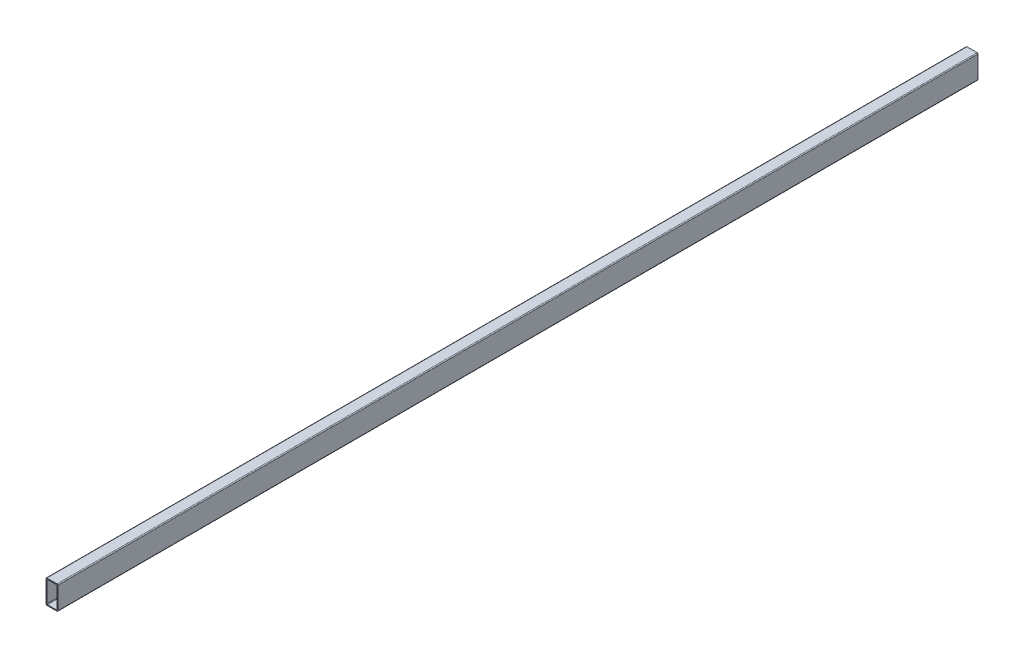
ISO-10303-21;
HEADER;
FILE_DESCRIPTION(('STEP AP214'),'2;1');
FILE_NAME('part.step','',(''),(''),'','','');
FILE_SCHEMA(('AUTOMOTIVE_DESIGN { 1 0 10303 214 1 1 1 1 }'));
ENDSEC;
DATA;
#1=APPLICATION_CONTEXT('core data for automotive mechanical design processes');
#2=APPLICATION_PROTOCOL_DEFINITION('international standard','automotive_design',2000,#1);
#3=PRODUCT_CONTEXT('',#1,'mechanical');
#4=PRODUCT('Part','Part','',(#3));
#5=PRODUCT_RELATED_PRODUCT_CATEGORY('part','',(#4));
#6=PRODUCT_DEFINITION_FORMATION('','',#4);
#7=PRODUCT_DEFINITION_CONTEXT('part definition',#1,'design');
#8=PRODUCT_DEFINITION('design','',#6,#7);
#9=PRODUCT_DEFINITION_SHAPE('','',#8);
#10=(LENGTH_UNIT() NAMED_UNIT(*) SI_UNIT(.MILLI.,.METRE.));
#11=(NAMED_UNIT(*) PLANE_ANGLE_UNIT() SI_UNIT($,.RADIAN.));
#12=(NAMED_UNIT(*) SI_UNIT($,.STERADIAN.) SOLID_ANGLE_UNIT());
#13=UNCERTAINTY_MEASURE_WITH_UNIT(LENGTH_MEASURE(1.E-05),#10,'distance_accuracy_value','');
#14=(GEOMETRIC_REPRESENTATION_CONTEXT(3) GLOBAL_UNCERTAINTY_ASSIGNED_CONTEXT((#13)) GLOBAL_UNIT_ASSIGNED_CONTEXT((#10,
#11,#12)) REPRESENTATION_CONTEXT('',''));
#15=CARTESIAN_POINT('',(0.,0.,0.));
#16=DIRECTION('',(0.,0.,1.));
#17=DIRECTION('',(1.,0.,0.));
#18=AXIS2_PLACEMENT_3D('',#15,#16,#17);
#19=CARTESIAN_POINT('',(8.49999999999997,38.4999999999999,-250.));
#20=DIRECTION('',(0.,0.,1.));
#21=DIRECTION('',(1.,0.,0.));
#22=AXIS2_PLACEMENT_3D('',#19,#20,#21);
#23=CYLINDRICAL_SURFACE('',#22,1.5);
#24=DIRECTION('',(0.,0.,1.));
#25=VECTOR('',#24,1.);
#26=CARTESIAN_POINT('',(8.49999999999995,39.9999999999999,-250.));
#27=LINE('',#26,#25);
#28=CARTESIAN_POINT('',(8.49999999999995,39.9999999999999,-250.));
#29=VERTEX_POINT('',#28);
#30=CARTESIAN_POINT('',(8.49999999999995,39.9999999999999,1300.));
#31=VERTEX_POINT('',#30);
#32=EDGE_CURVE('E37',#29,#31,#27,.T.);
#33=ORIENTED_EDGE('',*,*,#32,.T.);
#34=CARTESIAN_POINT('',(8.49999999999997,38.4999999999999,1300.));
#35=DIRECTION('',(0.,0.,1.));
#36=DIRECTION('',(-1.,0.,0.));
#37=AXIS2_PLACEMENT_3D('',#34,#35,#36);
#38=CIRCLE('',#37,1.5);
#39=CARTESIAN_POINT('',(9.99999999999997,38.4999999999999,1300.));
#40=VERTEX_POINT('',#39);
#41=EDGE_CURVE('E190',#40,#31,#38,.T.);
#42=ORIENTED_EDGE('',*,*,#41,.F.);
#43=DIRECTION('',(0.,0.,1.));
#44=VECTOR('',#43,1.);
#45=CARTESIAN_POINT('',(9.99999999999997,38.4999999999999,-250.));
#46=LINE('',#45,#44);
#47=CARTESIAN_POINT('',(9.99999999999997,38.4999999999999,-250.));
#48=VERTEX_POINT('',#47);
#49=EDGE_CURVE('E11',#48,#40,#46,.T.);
#50=ORIENTED_EDGE('',*,*,#49,.F.);
#51=CARTESIAN_POINT('',(8.49999999999997,38.4999999999999,-250.));
#52=DIRECTION('',(0.,0.,1.));
#53=DIRECTION('',(-1.,0.,0.));
#54=AXIS2_PLACEMENT_3D('',#51,#52,#53);
#55=CIRCLE('',#54,1.5);
#56=EDGE_CURVE('E233',#48,#29,#55,.T.);
#57=ORIENTED_EDGE('',*,*,#56,.T.);
#58=EDGE_LOOP('',(#33,#42,#50,#57));
#59=FACE_BOUND('',#58,.T.);
#60=ADVANCED_FACE('F34',(#59),#23,.T.);
#61=CARTESIAN_POINT('',(9.99999999999997,38.4999999999999,-250.));
#62=DIRECTION('',(1.,0.,0.));
#63=DIRECTION('',(0.,1.,0.));
#64=AXIS2_PLACEMENT_3D('',#61,#62,#63);
#65=PLANE('',#64);
#66=ORIENTED_EDGE('',*,*,#49,.T.);
#67=DIRECTION('',(0.,1.,0.));
#68=VECTOR('',#67,1.);
#69=CARTESIAN_POINT('',(9.99999999999997,38.4999999999999,1300.));
#70=LINE('',#69,#68);
#71=CARTESIAN_POINT('',(9.99999999999998,1.49999999999988,1300.));
#72=VERTEX_POINT('',#71);
#73=EDGE_CURVE('E211',#72,#40,#70,.T.);
#74=ORIENTED_EDGE('',*,*,#73,.F.);
#75=DIRECTION('',(0.,0.,1.));
#76=VECTOR('',#75,1.);
#77=CARTESIAN_POINT('',(9.99999999999998,1.49999999999988,-250.));
#78=LINE('',#77,#76);
#79=CARTESIAN_POINT('',(9.99999999999998,1.49999999999988,-250.));
#80=VERTEX_POINT('',#79);
#81=EDGE_CURVE('E42',#80,#72,#78,.T.);
#82=ORIENTED_EDGE('',*,*,#81,.F.);
#83=DIRECTION('',(0.,1.,0.));
#84=VECTOR('',#83,1.);
#85=CARTESIAN_POINT('',(9.99999999999997,38.4999999999999,-250.));
#86=LINE('',#85,#84);
#87=EDGE_CURVE('E264',#80,#48,#86,.T.);
#88=ORIENTED_EDGE('',*,*,#87,.T.);
#89=EDGE_LOOP('',(#66,#74,#82,#88));
#90=FACE_BOUND('',#89,.T.);
#91=ADVANCED_FACE('F285',(#90),#65,.T.);
#92=CARTESIAN_POINT('',(8.49999999999998,1.49999999999988,-250.));
#93=DIRECTION('',(0.,0.,1.));
#94=DIRECTION('',(1.,0.,0.));
#95=AXIS2_PLACEMENT_3D('',#92,#93,#94);
#96=CYLINDRICAL_SURFACE('',#95,1.5);
#97=ORIENTED_EDGE('',*,*,#81,.T.);
#98=CARTESIAN_POINT('',(8.49999999999998,1.49999999999988,1300.));
#99=DIRECTION('',(0.,0.,1.));
#100=DIRECTION('',(-1.,0.,0.));
#101=AXIS2_PLACEMENT_3D('',#98,#99,#100);
#102=CIRCLE('',#101,1.5);
#103=CARTESIAN_POINT('',(8.49999999999995,-1.2490009027033E-13,1300.));
#104=VERTEX_POINT('',#103);
#105=EDGE_CURVE('E208',#104,#72,#102,.T.);
#106=ORIENTED_EDGE('',*,*,#105,.F.);
#107=DIRECTION('',(0.,0.,1.));
#108=VECTOR('',#107,1.);
#109=CARTESIAN_POINT('',(8.49999999999995,-1.2490009027033E-13,-250.));
#110=LINE('',#109,#108);
#111=CARTESIAN_POINT('',(8.49999999999995,-1.2490009027033E-13,-250.));
#112=VERTEX_POINT('',#111);
#113=EDGE_CURVE('E268',#112,#104,#110,.T.);
#114=ORIENTED_EDGE('',*,*,#113,.F.);
#115=CARTESIAN_POINT('',(8.49999999999998,1.49999999999988,-250.));
#116=DIRECTION('',(0.,0.,1.));
#117=DIRECTION('',(-1.,0.,0.));
#118=AXIS2_PLACEMENT_3D('',#115,#116,#117);
#119=CIRCLE('',#118,1.5);
#120=EDGE_CURVE('E261',#112,#80,#119,.T.);
#121=ORIENTED_EDGE('',*,*,#120,.T.);
#122=EDGE_LOOP('',(#97,#106,#114,#121));
#123=FACE_BOUND('',#122,.T.);
#124=ADVANCED_FACE('F306',(#123),#96,.T.);
#125=CARTESIAN_POINT('',(-8.50000000000003,-1.2490009027033E-13,-250.));
#126=DIRECTION('',(0.,-1.,0.));
#127=DIRECTION('',(0.,0.,-1.));
#128=AXIS2_PLACEMENT_3D('',#125,#126,#127);
#129=PLANE('',#128);
#130=ORIENTED_EDGE('',*,*,#113,.T.);
#131=DIRECTION('',(1.,0.,0.));
#132=VECTOR('',#131,1.);
#133=CARTESIAN_POINT('',(-8.50000000000003,-1.2490009027033E-13,1300.));
#134=LINE('',#133,#132);
#135=CARTESIAN_POINT('',(-8.50000000000003,-1.2490009027033E-13,1300.));
#136=VERTEX_POINT('',#135);
#137=EDGE_CURVE('E205',#136,#104,#134,.T.);
#138=ORIENTED_EDGE('',*,*,#137,.F.);
#139=DIRECTION('',(0.,0.,1.));
#140=VECTOR('',#139,1.);
#141=CARTESIAN_POINT('',(-8.50000000000003,-1.2490009027033E-13,-250.));
#142=LINE('',#141,#140);
#143=CARTESIAN_POINT('',(-8.50000000000003,-1.2490009027033E-13,-250.));
#144=VERTEX_POINT('',#143);
#145=EDGE_CURVE('E270',#144,#136,#142,.T.);
#146=ORIENTED_EDGE('',*,*,#145,.F.);
#147=DIRECTION('',(1.,0.,0.));
#148=VECTOR('',#147,1.);
#149=CARTESIAN_POINT('',(-8.50000000000003,-1.2490009027033E-13,-250.));
#150=LINE('',#149,#148);
#151=EDGE_CURVE('E258',#144,#112,#150,.T.);
#152=ORIENTED_EDGE('',*,*,#151,.T.);
#153=EDGE_LOOP('',(#130,#138,#146,#152));
#154=FACE_BOUND('',#153,.T.);
#155=ADVANCED_FACE('F303',(#154),#129,.T.);
#156=CARTESIAN_POINT('',(-8.50000000000003,1.49999999999988,-250.));
#157=DIRECTION('',(0.,0.,1.));
#158=DIRECTION('',(1.,0.,0.));
#159=AXIS2_PLACEMENT_3D('',#156,#157,#158);
#160=CYLINDRICAL_SURFACE('',#159,1.5);
#161=ORIENTED_EDGE('',*,*,#145,.T.);
#162=CARTESIAN_POINT('',(-8.50000000000003,1.49999999999988,1300.));
#163=DIRECTION('',(0.,0.,1.));
#164=DIRECTION('',(1.,0.,0.));
#165=AXIS2_PLACEMENT_3D('',#162,#163,#164);
#166=CIRCLE('',#165,1.5);
#167=CARTESIAN_POINT('',(-10.,1.49999999999988,1300.));
#168=VERTEX_POINT('',#167);
#169=EDGE_CURVE('E202',#168,#136,#166,.T.);
#170=ORIENTED_EDGE('',*,*,#169,.F.);
#171=DIRECTION('',(0.,0.,1.));
#172=VECTOR('',#171,1.);
#173=CARTESIAN_POINT('',(-10.,1.49999999999988,-250.));
#174=LINE('',#173,#172);
#175=CARTESIAN_POINT('',(-10.,1.49999999999988,-250.));
#176=VERTEX_POINT('',#175);
#177=EDGE_CURVE('E272',#176,#168,#174,.T.);
#178=ORIENTED_EDGE('',*,*,#177,.F.);
#179=CARTESIAN_POINT('',(-8.50000000000003,1.49999999999988,-250.));
#180=DIRECTION('',(0.,0.,1.));
#181=DIRECTION('',(1.,0.,0.));
#182=AXIS2_PLACEMENT_3D('',#179,#180,#181);
#183=CIRCLE('',#182,1.5);
#184=EDGE_CURVE('E255',#176,#144,#183,.T.);
#185=ORIENTED_EDGE('',*,*,#184,.T.);
#186=EDGE_LOOP('',(#161,#170,#178,#185));
#187=FACE_BOUND('',#186,.T.);
#188=ADVANCED_FACE('F301',(#187),#160,.T.);
#189=CARTESIAN_POINT('',(-10.,38.4999999999999,-250.));
#190=DIRECTION('',(-1.,0.,0.));
#191=DIRECTION('',(0.,-1.,0.));
#192=AXIS2_PLACEMENT_3D('',#189,#190,#191);
#193=PLANE('',#192);
#194=ORIENTED_EDGE('',*,*,#177,.T.);
#195=DIRECTION('',(0.,-1.,0.));
#196=VECTOR('',#195,1.);
#197=CARTESIAN_POINT('',(-10.,38.4999999999999,1300.));
#198=LINE('',#197,#196);
#199=CARTESIAN_POINT('',(-10.,38.4999999999999,1300.));
#200=VERTEX_POINT('',#199);
#201=EDGE_CURVE('E199',#200,#168,#198,.T.);
#202=ORIENTED_EDGE('',*,*,#201,.F.);
#203=DIRECTION('',(0.,0.,1.));
#204=VECTOR('',#203,1.);
#205=CARTESIAN_POINT('',(-10.,38.4999999999999,-250.));
#206=LINE('',#205,#204);
#207=CARTESIAN_POINT('',(-10.,38.4999999999999,-250.));
#208=VERTEX_POINT('',#207);
#209=EDGE_CURVE('E274',#208,#200,#206,.T.);
#210=ORIENTED_EDGE('',*,*,#209,.F.);
#211=DIRECTION('',(0.,-1.,0.));
#212=VECTOR('',#211,1.);
#213=CARTESIAN_POINT('',(-10.,38.4999999999999,-250.));
#214=LINE('',#213,#212);
#215=EDGE_CURVE('E252',#208,#176,#214,.T.);
#216=ORIENTED_EDGE('',*,*,#215,.T.);
#217=EDGE_LOOP('',(#194,#202,#210,#216));
#218=FACE_BOUND('',#217,.T.);
#219=ADVANCED_FACE('F299',(#218),#193,.T.);
#220=CARTESIAN_POINT('',(-8.50000000000003,38.4999999999999,-250.));
#221=DIRECTION('',(0.,0.,1.));
#222=DIRECTION('',(1.,0.,0.));
#223=AXIS2_PLACEMENT_3D('',#220,#221,#222);
#224=CYLINDRICAL_SURFACE('',#223,1.50000000000001);
#225=ORIENTED_EDGE('',*,*,#209,.T.);
#226=CARTESIAN_POINT('',(-8.50000000000003,38.4999999999999,1300.));
#227=DIRECTION('',(0.,0.,1.));
#228=DIRECTION('',(-1.,0.,0.));
#229=AXIS2_PLACEMENT_3D('',#226,#227,#228);
#230=CIRCLE('',#229,1.50000000000001);
#231=CARTESIAN_POINT('',(-8.50000000000003,39.9999999999999,1300.));
#232=VERTEX_POINT('',#231);
#233=EDGE_CURVE('E196',#232,#200,#230,.T.);
#234=ORIENTED_EDGE('',*,*,#233,.F.);
#235=DIRECTION('',(0.,0.,1.));
#236=VECTOR('',#235,1.);
#237=CARTESIAN_POINT('',(-8.50000000000003,39.9999999999999,-250.));
#238=LINE('',#237,#236);
#239=CARTESIAN_POINT('',(-8.50000000000003,39.9999999999999,-250.));
#240=VERTEX_POINT('',#239);
#241=EDGE_CURVE('E275',#240,#232,#238,.T.);
#242=ORIENTED_EDGE('',*,*,#241,.F.);
#243=CARTESIAN_POINT('',(-8.50000000000003,38.4999999999999,-250.));
#244=DIRECTION('',(0.,0.,1.));
#245=DIRECTION('',(-1.,0.,0.));
#246=AXIS2_PLACEMENT_3D('',#243,#244,#245);
#247=CIRCLE('',#246,1.50000000000001);
#248=EDGE_CURVE('E249',#240,#208,#247,.T.);
#249=ORIENTED_EDGE('',*,*,#248,.T.);
#250=EDGE_LOOP('',(#225,#234,#242,#249));
#251=FACE_BOUND('',#250,.T.);
#252=ADVANCED_FACE('F295',(#251),#224,.T.);
#253=CARTESIAN_POINT('',(-8.50000000000003,39.9999999999999,-250.));
#254=DIRECTION('',(0.,1.,0.));
#255=DIRECTION('',(0.,0.,1.));
#256=AXIS2_PLACEMENT_3D('',#253,#254,#255);
#257=PLANE('',#256);
#258=ORIENTED_EDGE('',*,*,#241,.T.);
#259=DIRECTION('',(-1.,0.,0.));
#260=VECTOR('',#259,1.);
#261=CARTESIAN_POINT('',(-8.50000000000003,39.9999999999999,1300.));
#262=LINE('',#261,#260);
#263=EDGE_CURVE('E193',#31,#232,#262,.T.);
#264=ORIENTED_EDGE('',*,*,#263,.F.);
#265=ORIENTED_EDGE('',*,*,#32,.F.);
#266=DIRECTION('',(-1.,0.,0.));
#267=VECTOR('',#266,1.);
#268=CARTESIAN_POINT('',(-8.50000000000003,39.9999999999999,-250.));
#269=LINE('',#268,#267);
#270=EDGE_CURVE('E246',#29,#240,#269,.T.);
#271=ORIENTED_EDGE('',*,*,#270,.T.);
#272=EDGE_LOOP('',(#258,#264,#265,#271));
#273=FACE_BOUND('',#272,.T.);
#274=ADVANCED_FACE('F279',(#273),#257,.T.);
#275=CARTESIAN_POINT('',(8.49999999999997,38.4999999999999,-250.));
#276=DIRECTION('',(0.,0.,-1.));
#277=DIRECTION('',(-1.,0.,0.));
#278=AXIS2_PLACEMENT_3D('',#275,#276,#277);
#279=PLANE('',#278);
#280=CARTESIAN_POINT('',(7.49999999999997,2.49999999999988,-250.));
#281=DIRECTION('',(0.,0.,1.));
#282=DIRECTION('',(-1.,0.,0.));
#283=AXIS2_PLACEMENT_3D('',#280,#281,#282);
#284=CIRCLE('',#283,0.999999999999994);
#285=CARTESIAN_POINT('',(7.49999999999997,1.49999999999989,-250.));
#286=VERTEX_POINT('',#285);
#287=CARTESIAN_POINT('',(8.49999999999998,2.49999999999988,-250.));
#288=VERTEX_POINT('',#287);
#289=EDGE_CURVE('E214',#286,#288,#284,.T.);
#290=ORIENTED_EDGE('',*,*,#289,.T.);
#291=DIRECTION('',(0.,1.,0.));
#292=VECTOR('',#291,1.);
#293=CARTESIAN_POINT('',(8.49999999999997,37.4999999999999,-250.));
#294=LINE('',#293,#292);
#295=CARTESIAN_POINT('',(8.49999999999997,37.4999999999999,-250.));
#296=VERTEX_POINT('',#295);
#297=EDGE_CURVE('E154',#288,#296,#294,.T.);
#298=ORIENTED_EDGE('',*,*,#297,.T.);
#299=CARTESIAN_POINT('',(7.49999999999997,37.4999999999999,-250.));
#300=DIRECTION('',(0.,0.,1.));
#301=DIRECTION('',(-1.,0.,0.));
#302=AXIS2_PLACEMENT_3D('',#299,#300,#301);
#303=CIRCLE('',#302,1.);
#304=CARTESIAN_POINT('',(7.49999999999997,38.4999999999999,-250.));
#305=VERTEX_POINT('',#304);
#306=EDGE_CURVE('E50',#296,#305,#303,.T.);
#307=ORIENTED_EDGE('',*,*,#306,.T.);
#308=DIRECTION('',(-1.,0.,0.));
#309=VECTOR('',#308,1.);
#310=CARTESIAN_POINT('',(-7.50000000000003,38.4999999999999,-250.));
#311=LINE('',#310,#309);
#312=CARTESIAN_POINT('',(-7.50000000000003,38.4999999999999,-250.));
#313=VERTEX_POINT('',#312);
#314=EDGE_CURVE('E218',#305,#313,#311,.T.);
#315=ORIENTED_EDGE('',*,*,#314,.T.);
#316=CARTESIAN_POINT('',(-7.50000000000003,37.4999999999999,-250.));
#317=DIRECTION('',(0.,0.,1.));
#318=DIRECTION('',(-1.,0.,0.));
#319=AXIS2_PLACEMENT_3D('',#316,#317,#318);
#320=CIRCLE('',#319,1.);
#321=CARTESIAN_POINT('',(-8.50000000000003,37.4999999999999,-250.));
#322=VERTEX_POINT('',#321);
#323=EDGE_CURVE('E221',#313,#322,#320,.T.);
#324=ORIENTED_EDGE('',*,*,#323,.T.);
#325=DIRECTION('',(0.,-1.,0.));
#326=VECTOR('',#325,1.);
#327=CARTESIAN_POINT('',(-8.50000000000003,37.4999999999999,-250.));
#328=LINE('',#327,#326);
#329=CARTESIAN_POINT('',(-8.50000000000002,2.49999999999988,-250.));
#330=VERTEX_POINT('',#329);
#331=EDGE_CURVE('E224',#322,#330,#328,.T.);
#332=ORIENTED_EDGE('',*,*,#331,.T.);
#333=CARTESIAN_POINT('',(-7.50000000000003,2.49999999999988,-250.));
#334=DIRECTION('',(0.,0.,1.));
#335=DIRECTION('',(1.,0.,0.));
#336=AXIS2_PLACEMENT_3D('',#333,#334,#335);
#337=CIRCLE('',#336,0.999999999999997);
#338=CARTESIAN_POINT('',(-7.50000000000003,1.49999999999988,-250.));
#339=VERTEX_POINT('',#338);
#340=EDGE_CURVE('E227',#330,#339,#337,.T.);
#341=ORIENTED_EDGE('',*,*,#340,.T.);
#342=DIRECTION('',(1.,0.,0.));
#343=VECTOR('',#342,1.);
#344=CARTESIAN_POINT('',(-7.50000000000003,1.49999999999988,-250.));
#345=LINE('',#344,#343);
#346=EDGE_CURVE('E159',#339,#286,#345,.T.);
#347=ORIENTED_EDGE('',*,*,#346,.T.);
#348=EDGE_LOOP('',(#290,#298,#307,#315,#324,#332,#341,#347));
#349=FACE_BOUND('',#348,.T.);
#350=ORIENTED_EDGE('',*,*,#56,.F.);
#351=ORIENTED_EDGE('',*,*,#87,.F.);
#352=ORIENTED_EDGE('',*,*,#120,.F.);
#353=ORIENTED_EDGE('',*,*,#151,.F.);
#354=ORIENTED_EDGE('',*,*,#184,.F.);
#355=ORIENTED_EDGE('',*,*,#215,.F.);
#356=ORIENTED_EDGE('',*,*,#248,.F.);
#357=ORIENTED_EDGE('',*,*,#270,.F.);
#358=EDGE_LOOP('',(#350,#351,#352,#353,#354,#355,#356,#357));
#359=FACE_BOUND('',#358,.T.);
#360=ADVANCED_FACE('F289',(#349,#359),#279,.T.);
#361=CARTESIAN_POINT('',(7.49999999999997,2.49999999999988,-250.));
#362=DIRECTION('',(0.,0.,1.));
#363=DIRECTION('',(1.,0.,0.));
#364=AXIS2_PLACEMENT_3D('',#361,#362,#363);
#365=CYLINDRICAL_SURFACE('',#364,0.999999999999994);
#366=DIRECTION('',(0.,0.,1.));
#367=VECTOR('',#366,1.);
#368=CARTESIAN_POINT('',(7.49999999999997,1.49999999999989,-250.));
#369=LINE('',#368,#367);
#370=CARTESIAN_POINT('',(7.49999999999997,1.49999999999989,1300.));
#371=VERTEX_POINT('',#370);
#372=EDGE_CURVE('E164',#286,#371,#369,.T.);
#373=ORIENTED_EDGE('',*,*,#372,.T.);
#374=CARTESIAN_POINT('',(7.49999999999997,2.49999999999988,1300.));
#375=DIRECTION('',(0.,0.,1.));
#376=DIRECTION('',(-1.,0.,0.));
#377=AXIS2_PLACEMENT_3D('',#374,#375,#376);
#378=CIRCLE('',#377,0.999999999999994);
#379=CARTESIAN_POINT('',(8.49999999999998,2.49999999999988,1300.));
#380=VERTEX_POINT('',#379);
#381=EDGE_CURVE('E162',#371,#380,#378,.T.);
#382=ORIENTED_EDGE('',*,*,#381,.T.);
#383=DIRECTION('',(0.,0.,1.));
#384=VECTOR('',#383,1.);
#385=CARTESIAN_POINT('',(8.49999999999998,2.49999999999988,-250.));
#386=LINE('',#385,#384);
#387=EDGE_CURVE('E147',#288,#380,#386,.T.);
#388=ORIENTED_EDGE('',*,*,#387,.F.);
#389=ORIENTED_EDGE('',*,*,#289,.F.);
#390=EDGE_LOOP('',(#373,#382,#388,#389));
#391=FACE_BOUND('',#390,.T.);
#392=ADVANCED_FACE('F163',(#391),#365,.F.);
#393=CARTESIAN_POINT('',(-7.50000000000003,1.49999999999988,-250.));
#394=DIRECTION('',(0.,-1.,0.));
#395=DIRECTION('',(1.,0.,0.));
#396=AXIS2_PLACEMENT_3D('',#393,#394,#395);
#397=PLANE('',#396);
#398=DIRECTION('',(0.,0.,1.));
#399=VECTOR('',#398,1.);
#400=CARTESIAN_POINT('',(-7.50000000000003,1.49999999999988,-250.));
#401=LINE('',#400,#399);
#402=CARTESIAN_POINT('',(-7.50000000000003,1.49999999999988,1300.));
#403=VERTEX_POINT('',#402);
#404=EDGE_CURVE('E234',#339,#403,#401,.T.);
#405=ORIENTED_EDGE('',*,*,#404,.T.);
#406=DIRECTION('',(1.,0.,0.));
#407=VECTOR('',#406,1.);
#408=CARTESIAN_POINT('',(-7.50000000000003,1.49999999999988,1300.));
#409=LINE('',#408,#407);
#410=EDGE_CURVE('E188',#403,#371,#409,.T.);
#411=ORIENTED_EDGE('',*,*,#410,.T.);
#412=ORIENTED_EDGE('',*,*,#372,.F.);
#413=ORIENTED_EDGE('',*,*,#346,.F.);
#414=EDGE_LOOP('',(#405,#411,#412,#413));
#415=FACE_BOUND('',#414,.T.);
#416=ADVANCED_FACE('F381',(#415),#397,.F.);
#417=CARTESIAN_POINT('',(-7.50000000000003,2.49999999999988,-250.));
#418=DIRECTION('',(0.,0.,1.));
#419=DIRECTION('',(1.,0.,0.));
#420=AXIS2_PLACEMENT_3D('',#417,#418,#419);
#421=CYLINDRICAL_SURFACE('',#420,0.999999999999997);
#422=DIRECTION('',(0.,0.,1.));
#423=VECTOR('',#422,1.);
#424=CARTESIAN_POINT('',(-8.50000000000002,2.49999999999988,-250.));
#425=LINE('',#424,#423);
#426=CARTESIAN_POINT('',(-8.50000000000002,2.49999999999988,1300.));
#427=VERTEX_POINT('',#426);
#428=EDGE_CURVE('E236',#330,#427,#425,.T.);
#429=ORIENTED_EDGE('',*,*,#428,.T.);
#430=CARTESIAN_POINT('',(-7.50000000000003,2.49999999999988,1300.));
#431=DIRECTION('',(0.,0.,1.));
#432=DIRECTION('',(1.,0.,0.));
#433=AXIS2_PLACEMENT_3D('',#430,#431,#432);
#434=CIRCLE('',#433,0.999999999999997);
#435=EDGE_CURVE('E185',#427,#403,#434,.T.);
#436=ORIENTED_EDGE('',*,*,#435,.T.);
#437=ORIENTED_EDGE('',*,*,#404,.F.);
#438=ORIENTED_EDGE('',*,*,#340,.F.);
#439=EDGE_LOOP('',(#429,#436,#437,#438));
#440=FACE_BOUND('',#439,.T.);
#441=ADVANCED_FACE('F390',(#440),#421,.F.);
#442=CARTESIAN_POINT('',(-8.50000000000003,37.4999999999999,-250.));
#443=DIRECTION('',(-1.,0.,0.));
#444=DIRECTION('',(0.,-1.,0.));
#445=AXIS2_PLACEMENT_3D('',#442,#443,#444);
#446=PLANE('',#445);
#447=DIRECTION('',(0.,0.,1.));
#448=VECTOR('',#447,1.);
#449=CARTESIAN_POINT('',(-8.50000000000003,37.4999999999999,-250.));
#450=LINE('',#449,#448);
#451=CARTESIAN_POINT('',(-8.50000000000003,37.4999999999999,1300.));
#452=VERTEX_POINT('',#451);
#453=EDGE_CURVE('E238',#322,#452,#450,.T.);
#454=ORIENTED_EDGE('',*,*,#453,.T.);
#455=DIRECTION('',(0.,-1.,0.));
#456=VECTOR('',#455,1.);
#457=CARTESIAN_POINT('',(-8.50000000000003,37.4999999999999,1300.));
#458=LINE('',#457,#456);
#459=EDGE_CURVE('E182',#452,#427,#458,.T.);
#460=ORIENTED_EDGE('',*,*,#459,.T.);
#461=ORIENTED_EDGE('',*,*,#428,.F.);
#462=ORIENTED_EDGE('',*,*,#331,.F.);
#463=EDGE_LOOP('',(#454,#460,#461,#462));
#464=FACE_BOUND('',#463,.T.);
#465=ADVANCED_FACE('F400',(#464),#446,.F.);
#466=CARTESIAN_POINT('',(-7.50000000000003,37.4999999999999,-250.));
#467=DIRECTION('',(0.,0.,1.));
#468=DIRECTION('',(1.,0.,0.));
#469=AXIS2_PLACEMENT_3D('',#466,#467,#468);
#470=CYLINDRICAL_SURFACE('',#469,1.);
#471=DIRECTION('',(0.,0.,1.));
#472=VECTOR('',#471,1.);
#473=CARTESIAN_POINT('',(-7.50000000000003,38.4999999999999,-250.));
#474=LINE('',#473,#472);
#475=CARTESIAN_POINT('',(-7.50000000000003,38.4999999999999,1300.));
#476=VERTEX_POINT('',#475);
#477=EDGE_CURVE('E240',#313,#476,#474,.T.);
#478=ORIENTED_EDGE('',*,*,#477,.T.);
#479=CARTESIAN_POINT('',(-7.50000000000003,37.4999999999999,1300.));
#480=DIRECTION('',(0.,0.,1.));
#481=DIRECTION('',(-1.,0.,0.));
#482=AXIS2_PLACEMENT_3D('',#479,#480,#481);
#483=CIRCLE('',#482,1.);
#484=EDGE_CURVE('E179',#476,#452,#483,.T.);
#485=ORIENTED_EDGE('',*,*,#484,.T.);
#486=ORIENTED_EDGE('',*,*,#453,.F.);
#487=ORIENTED_EDGE('',*,*,#323,.F.);
#488=EDGE_LOOP('',(#478,#485,#486,#487));
#489=FACE_BOUND('',#488,.T.);
#490=ADVANCED_FACE('F410',(#489),#470,.F.);
#491=CARTESIAN_POINT('',(-7.50000000000003,38.4999999999999,-250.));
#492=DIRECTION('',(0.,1.,0.));
#493=DIRECTION('',(-1.,0.,0.));
#494=AXIS2_PLACEMENT_3D('',#491,#492,#493);
#495=PLANE('',#494);
#496=DIRECTION('',(0.,0.,1.));
#497=VECTOR('',#496,1.);
#498=CARTESIAN_POINT('',(7.49999999999997,38.4999999999999,-250.));
#499=LINE('',#498,#497);
#500=CARTESIAN_POINT('',(7.49999999999997,38.4999999999999,1300.));
#501=VERTEX_POINT('',#500);
#502=EDGE_CURVE('E242',#305,#501,#499,.T.);
#503=ORIENTED_EDGE('',*,*,#502,.T.);
#504=DIRECTION('',(-1.,0.,0.));
#505=VECTOR('',#504,1.);
#506=CARTESIAN_POINT('',(-7.50000000000003,38.4999999999999,1300.));
#507=LINE('',#506,#505);
#508=EDGE_CURVE('E174',#501,#476,#507,.T.);
#509=ORIENTED_EDGE('',*,*,#508,.T.);
#510=ORIENTED_EDGE('',*,*,#477,.F.);
#511=ORIENTED_EDGE('',*,*,#314,.F.);
#512=EDGE_LOOP('',(#503,#509,#510,#511));
#513=FACE_BOUND('',#512,.T.);
#514=ADVANCED_FACE('F420',(#513),#495,.F.);
#515=CARTESIAN_POINT('',(7.49999999999997,37.4999999999999,-250.));
#516=DIRECTION('',(0.,0.,1.));
#517=DIRECTION('',(1.,0.,0.));
#518=AXIS2_PLACEMENT_3D('',#515,#516,#517);
#519=CYLINDRICAL_SURFACE('',#518,1.);
#520=DIRECTION('',(0.,0.,1.));
#521=VECTOR('',#520,1.);
#522=CARTESIAN_POINT('',(8.49999999999997,37.4999999999999,-250.));
#523=LINE('',#522,#521);
#524=CARTESIAN_POINT('',(8.49999999999997,37.4999999999999,1300.));
#525=VERTEX_POINT('',#524);
#526=EDGE_CURVE('E158',#296,#525,#523,.T.);
#527=ORIENTED_EDGE('',*,*,#526,.T.);
#528=CARTESIAN_POINT('',(7.49999999999997,37.4999999999999,1300.));
#529=DIRECTION('',(0.,0.,1.));
#530=DIRECTION('',(-1.,0.,0.));
#531=AXIS2_PLACEMENT_3D('',#528,#529,#530);
#532=CIRCLE('',#531,1.);
#533=EDGE_CURVE('E172',#525,#501,#532,.T.);
#534=ORIENTED_EDGE('',*,*,#533,.T.);
#535=ORIENTED_EDGE('',*,*,#502,.F.);
#536=ORIENTED_EDGE('',*,*,#306,.F.);
#537=EDGE_LOOP('',(#527,#534,#535,#536));
#538=FACE_BOUND('',#537,.T.);
#539=ADVANCED_FACE('F430',(#538),#519,.F.);
#540=CARTESIAN_POINT('',(8.49999999999997,37.4999999999999,-250.));
#541=DIRECTION('',(1.,0.,0.));
#542=DIRECTION('',(0.,1.,0.));
#543=AXIS2_PLACEMENT_3D('',#540,#541,#542);
#544=PLANE('',#543);
#545=ORIENTED_EDGE('',*,*,#387,.T.);
#546=DIRECTION('',(0.,1.,0.));
#547=VECTOR('',#546,1.);
#548=CARTESIAN_POINT('',(8.49999999999997,37.4999999999999,1300.));
#549=LINE('',#548,#547);
#550=EDGE_CURVE('E151',#380,#525,#549,.T.);
#551=ORIENTED_EDGE('',*,*,#550,.T.);
#552=ORIENTED_EDGE('',*,*,#526,.F.);
#553=ORIENTED_EDGE('',*,*,#297,.F.);
#554=EDGE_LOOP('',(#545,#551,#552,#553));
#555=FACE_BOUND('',#554,.T.);
#556=ADVANCED_FACE('F149',(#555),#544,.F.);
#557=CARTESIAN_POINT('',(8.49999999999997,38.4999999999999,1300.));
#558=DIRECTION('',(0.,0.,-1.));
#559=DIRECTION('',(-1.,0.,0.));
#560=AXIS2_PLACEMENT_3D('',#557,#558,#559);
#561=PLANE('',#560);
#562=ORIENTED_EDGE('',*,*,#41,.T.);
#563=ORIENTED_EDGE('',*,*,#263,.T.);
#564=ORIENTED_EDGE('',*,*,#233,.T.);
#565=ORIENTED_EDGE('',*,*,#201,.T.);
#566=ORIENTED_EDGE('',*,*,#169,.T.);
#567=ORIENTED_EDGE('',*,*,#137,.T.);
#568=ORIENTED_EDGE('',*,*,#105,.T.);
#569=ORIENTED_EDGE('',*,*,#73,.T.);
#570=EDGE_LOOP('',(#562,#563,#564,#565,#566,#567,#568,#569));
#571=FACE_BOUND('',#570,.T.);
#572=ORIENTED_EDGE('',*,*,#381,.F.);
#573=ORIENTED_EDGE('',*,*,#410,.F.);
#574=ORIENTED_EDGE('',*,*,#435,.F.);
#575=ORIENTED_EDGE('',*,*,#459,.F.);
#576=ORIENTED_EDGE('',*,*,#484,.F.);
#577=ORIENTED_EDGE('',*,*,#508,.F.);
#578=ORIENTED_EDGE('',*,*,#533,.F.);
#579=ORIENTED_EDGE('',*,*,#550,.F.);
#580=EDGE_LOOP('',(#572,#573,#574,#575,#576,#577,#578,#579));
#581=FACE_BOUND('',#580,.T.);
#582=ADVANCED_FACE('F169',(#571,#581),#561,.F.);
#583=CLOSED_SHELL('',(#60,#91,#124,#155,#188,#219,#252,#274,#360,#392,#416,#441,#465,#490,#514,
#539,#556,#582));
#584=MANIFOLD_SOLID_BREP('B2',#583);
#585=ADVANCED_BREP_SHAPE_REPRESENTATION('',(#18,#584),#14);
#586=SHAPE_DEFINITION_REPRESENTATION(#9,#585);
ENDSEC;
END-ISO-10303-21;
